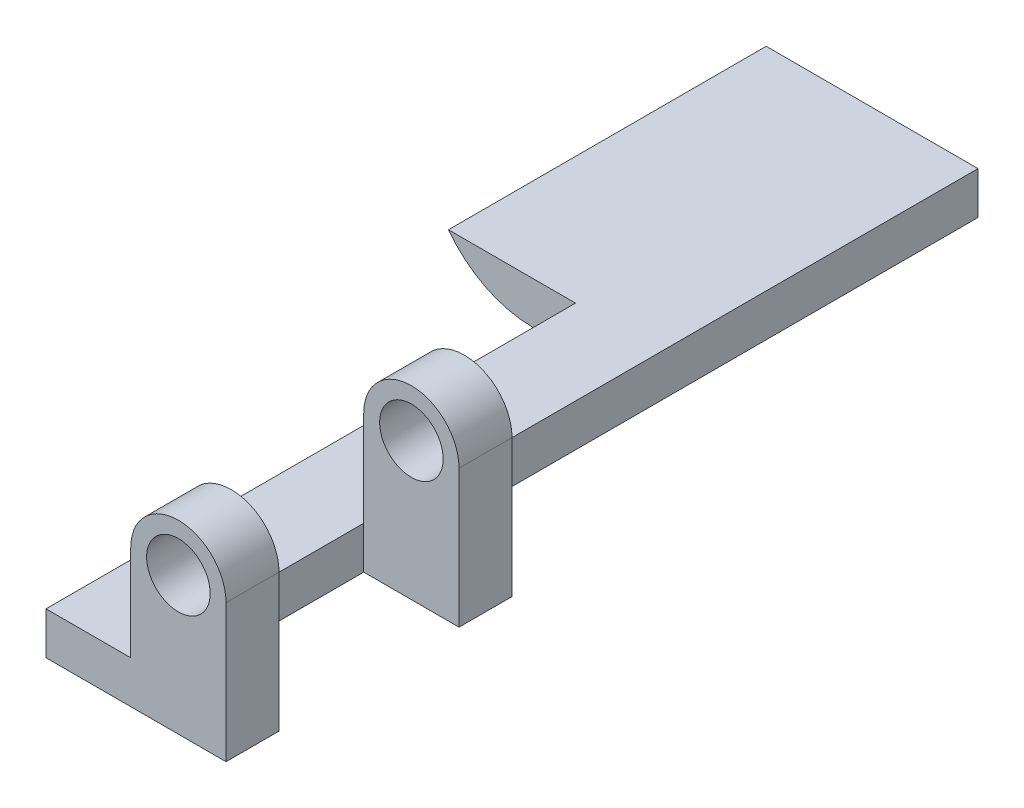
ISO-10303-21;
HEADER;
FILE_DESCRIPTION(('STEP AP214'),'2;1');
FILE_NAME('part.step','',(''),(''),'','','');
FILE_SCHEMA(('AUTOMOTIVE_DESIGN { 1 0 10303 214 1 1 1 1 }'));
ENDSEC;
DATA;
#1=APPLICATION_CONTEXT('core data for automotive mechanical design processes');
#2=APPLICATION_PROTOCOL_DEFINITION('international standard','automotive_design',2000,#1);
#3=PRODUCT_CONTEXT('',#1,'mechanical');
#4=PRODUCT('Part','Part','',(#3));
#5=PRODUCT_RELATED_PRODUCT_CATEGORY('part','',(#4));
#6=PRODUCT_DEFINITION_FORMATION('','',#4);
#7=PRODUCT_DEFINITION_CONTEXT('part definition',#1,'design');
#8=PRODUCT_DEFINITION('design','',#6,#7);
#9=PRODUCT_DEFINITION_SHAPE('','',#8);
#10=(LENGTH_UNIT() NAMED_UNIT(*) SI_UNIT(.MILLI.,.METRE.));
#11=(NAMED_UNIT(*) PLANE_ANGLE_UNIT() SI_UNIT($,.RADIAN.));
#12=(NAMED_UNIT(*) SI_UNIT($,.STERADIAN.) SOLID_ANGLE_UNIT());
#13=UNCERTAINTY_MEASURE_WITH_UNIT(LENGTH_MEASURE(1.E-05),#10,'distance_accuracy_value','');
#14=(GEOMETRIC_REPRESENTATION_CONTEXT(3) GLOBAL_UNCERTAINTY_ASSIGNED_CONTEXT((#13)) GLOBAL_UNIT_ASSIGNED_CONTEXT((#10,
#11,#12)) REPRESENTATION_CONTEXT('',''));
#15=CARTESIAN_POINT('',(0.,0.,0.));
#16=DIRECTION('',(0.,0.,1.));
#17=DIRECTION('',(1.,0.,0.));
#18=AXIS2_PLACEMENT_3D('',#15,#16,#17);
#19=CARTESIAN_POINT('',(50.6295676154831,0.,37.));
#20=DIRECTION('',(-1.,0.,0.));
#21=DIRECTION('',(0.,0.,1.));
#22=AXIS2_PLACEMENT_3D('',#19,#20,#21);
#23=PLANE('',#22);
#24=DIRECTION('',(0.,0.,-1.));
#25=VECTOR('',#24,1.);
#26=CARTESIAN_POINT('',(50.6295676154831,19.9021158128185,37.));
#27=LINE('',#26,#25);
#28=CARTESIAN_POINT('',(50.6295676154831,19.9021158128185,37.));
#29=VERTEX_POINT('',#28);
#30=CARTESIAN_POINT('',(50.6295676154831,19.9021158128185,32.));
#31=VERTEX_POINT('',#30);
#32=EDGE_CURVE('E166',#29,#31,#27,.T.);
#33=ORIENTED_EDGE('',*,*,#32,.T.);
#34=DIRECTION('',(0.,-1.,0.));
#35=VECTOR('',#34,1.);
#36=CARTESIAN_POINT('',(50.6295676154831,38.9021158128185,32.));
#37=LINE('',#36,#35);
#38=CARTESIAN_POINT('',(50.6295676154831,32.9021158128185,32.));
#39=VERTEX_POINT('',#38);
#40=EDGE_CURVE('E312',#39,#31,#37,.T.);
#41=ORIENTED_EDGE('',*,*,#40,.F.);
#42=DIRECTION('',(0.,0.,-1.));
#43=VECTOR('',#42,1.);
#44=CARTESIAN_POINT('',(50.6295676154831,32.9021158128185,37.));
#45=LINE('',#44,#43);
#46=CARTESIAN_POINT('',(50.6295676154831,32.9021158128185,37.));
#47=VERTEX_POINT('',#46);
#48=EDGE_CURVE('E167',#47,#39,#45,.T.);
#49=ORIENTED_EDGE('',*,*,#48,.F.);
#50=DIRECTION('',(0.,1.,0.));
#51=VECTOR('',#50,1.);
#52=CARTESIAN_POINT('',(50.6295676154831,0.,37.));
#53=LINE('',#52,#51);
#54=EDGE_CURVE('E225',#29,#47,#53,.T.);
#55=ORIENTED_EDGE('',*,*,#54,.F.);
#56=EDGE_LOOP('',(#33,#41,#49,#55));
#57=FACE_BOUND('',#56,.T.);
#58=ADVANCED_FACE('F35',(#57),#23,.F.);
#59=CARTESIAN_POINT('',(46.1295676154831,32.9021158128185,37.));
#60=DIRECTION('',(0.,0.,-1.));
#61=DIRECTION('',(-1.,0.,0.));
#62=AXIS2_PLACEMENT_3D('',#59,#60,#61);
#63=CYLINDRICAL_SURFACE('',#62,4.5);
#64=CARTESIAN_POINT('',(46.1295676154831,32.9021158128185,32.));
#65=DIRECTION('',(0.,0.,1.));
#66=DIRECTION('',(1.,0.,0.));
#67=AXIS2_PLACEMENT_3D('',#64,#65,#66);
#68=CIRCLE('',#67,4.5);
#69=CARTESIAN_POINT('',(41.6295676154831,32.9021158128185,32.));
#70=VERTEX_POINT('',#69);
#71=EDGE_CURVE('E186',#70,#39,#68,.F.);
#72=ORIENTED_EDGE('',*,*,#71,.F.);
#73=DIRECTION('',(0.,0.,-1.));
#74=VECTOR('',#73,1.);
#75=CARTESIAN_POINT('',(41.6295676154831,32.9021158128185,37.));
#76=LINE('',#75,#74);
#77=CARTESIAN_POINT('',(41.6295676154831,32.9021158128185,37.));
#78=VERTEX_POINT('',#77);
#79=EDGE_CURVE('E246',#78,#70,#76,.T.);
#80=ORIENTED_EDGE('',*,*,#79,.F.);
#81=CARTESIAN_POINT('',(46.1295676154831,32.9021158128185,37.));
#82=DIRECTION('',(0.,0.,1.));
#83=DIRECTION('',(1.,0.,0.));
#84=AXIS2_PLACEMENT_3D('',#81,#82,#83);
#85=CIRCLE('',#84,4.5);
#86=EDGE_CURVE('E227',#78,#47,#85,.F.);
#87=ORIENTED_EDGE('',*,*,#86,.T.);
#88=ORIENTED_EDGE('',*,*,#48,.T.);
#89=EDGE_LOOP('',(#72,#80,#87,#88));
#90=FACE_BOUND('',#89,.T.);
#91=ADVANCED_FACE('F261',(#90),#63,.T.);
#92=CARTESIAN_POINT('',(41.6295676154831,0.,37.));
#93=DIRECTION('',(-1.,0.,0.));
#94=DIRECTION('',(0.,-1.,0.));
#95=AXIS2_PLACEMENT_3D('',#92,#93,#94);
#96=PLANE('',#95);
#97=DIRECTION('',(0.,-1.,0.));
#98=VECTOR('',#97,1.);
#99=CARTESIAN_POINT('',(41.6295676154831,38.9021158128185,32.));
#100=LINE('',#99,#98);
#101=CARTESIAN_POINT('',(41.6295676154831,23.9021158128185,32.));
#102=VERTEX_POINT('',#101);
#103=EDGE_CURVE('E161',#70,#102,#100,.T.);
#104=ORIENTED_EDGE('',*,*,#103,.T.);
#105=DIRECTION('',(0.,0.,-1.));
#106=VECTOR('',#105,1.);
#107=CARTESIAN_POINT('',(41.6295676154831,23.9021158128185,37.));
#108=LINE('',#107,#106);
#109=CARTESIAN_POINT('',(41.6295676154831,23.9021158128185,37.));
#110=VERTEX_POINT('',#109);
#111=EDGE_CURVE('E242',#110,#102,#108,.T.);
#112=ORIENTED_EDGE('',*,*,#111,.F.);
#113=DIRECTION('',(0.,1.,0.));
#114=VECTOR('',#113,1.);
#115=CARTESIAN_POINT('',(41.6295676154831,0.,37.));
#116=LINE('',#115,#114);
#117=EDGE_CURVE('E230',#110,#78,#116,.T.);
#118=ORIENTED_EDGE('',*,*,#117,.T.);
#119=ORIENTED_EDGE('',*,*,#79,.T.);
#120=EDGE_LOOP('',(#104,#112,#118,#119));
#121=FACE_BOUND('',#120,.T.);
#122=ADVANCED_FACE('F268',(#121),#96,.T.);
#123=CARTESIAN_POINT('',(46.1295676154831,32.9021158128185,37.));
#124=DIRECTION('',(0.,0.,-1.));
#125=DIRECTION('',(-1.,0.,0.));
#126=AXIS2_PLACEMENT_3D('',#123,#124,#125);
#127=CYLINDRICAL_SURFACE('',#126,3.);
#128=CARTESIAN_POINT('',(46.1295676154831,32.9021158128185,32.));
#129=DIRECTION('',(0.,0.,1.));
#130=DIRECTION('',(1.,0.,0.));
#131=AXIS2_PLACEMENT_3D('',#128,#129,#130);
#132=CIRCLE('',#131,3.);
#133=CARTESIAN_POINT('',(49.1295676154831,32.9021158128185,32.));
#134=VERTEX_POINT('',#133);
#135=EDGE_CURVE('E184',#134,#134,#132,.T.);
#136=ORIENTED_EDGE('',*,*,#135,.F.);
#137=EDGE_LOOP('',(#136));
#138=FACE_BOUND('',#137,.T.);
#139=CARTESIAN_POINT('',(46.1295676154831,32.9021158128185,37.));
#140=DIRECTION('',(0.,0.,1.));
#141=DIRECTION('',(1.,0.,0.));
#142=AXIS2_PLACEMENT_3D('',#139,#140,#141);
#143=CIRCLE('',#142,3.);
#144=CARTESIAN_POINT('',(49.1295676154831,32.9021158128185,37.));
#145=VERTEX_POINT('',#144);
#146=EDGE_CURVE('E236',#145,#145,#143,.T.);
#147=ORIENTED_EDGE('',*,*,#146,.T.);
#148=EDGE_LOOP('',(#147));
#149=FACE_BOUND('',#148,.T.);
#150=ADVANCED_FACE('F280',(#138,#149),#127,.F.);
#151=CARTESIAN_POINT('',(33.6295676154831,0.,37.));
#152=DIRECTION('',(-1.,0.,0.));
#153=DIRECTION('',(0.,0.,1.));
#154=AXIS2_PLACEMENT_3D('',#151,#152,#153);
#155=PLANE('',#154);
#156=DIRECTION('',(0.,0.,-1.));
#157=VECTOR('',#156,1.);
#158=CARTESIAN_POINT('',(33.6295676154831,23.9021158128185,37.));
#159=LINE('',#158,#157);
#160=CARTESIAN_POINT('',(33.6295676154831,23.9021158128185,37.));
#161=VERTEX_POINT('',#160);
#162=CARTESIAN_POINT('',(33.6295676154831,23.9021158128185,-13.));
#163=VERTEX_POINT('',#162);
#164=EDGE_CURVE('E239',#161,#163,#159,.T.);
#165=ORIENTED_EDGE('',*,*,#164,.T.);
#166=DIRECTION('',(0.,1.,0.));
#167=VECTOR('',#166,1.);
#168=CARTESIAN_POINT('',(33.6295676154831,19.9021158128185,-13.));
#169=LINE('',#168,#167);
#170=CARTESIAN_POINT('',(33.6295676154831,19.9021158128185,-13.));
#171=VERTEX_POINT('',#170);
#172=EDGE_CURVE('E213',#171,#163,#169,.T.);
#173=ORIENTED_EDGE('',*,*,#172,.F.);
#174=DIRECTION('',(0.,0.,-1.));
#175=VECTOR('',#174,1.);
#176=CARTESIAN_POINT('',(33.6295676154831,19.9021158128185,37.));
#177=LINE('',#176,#175);
#178=CARTESIAN_POINT('',(33.6295676154831,19.9021158128185,37.));
#179=VERTEX_POINT('',#178);
#180=EDGE_CURVE('E170',#179,#171,#177,.T.);
#181=ORIENTED_EDGE('',*,*,#180,.F.);
#182=DIRECTION('',(0.,1.,0.));
#183=VECTOR('',#182,1.);
#184=CARTESIAN_POINT('',(33.6295676154831,0.,37.));
#185=LINE('',#184,#183);
#186=EDGE_CURVE('E219',#179,#161,#185,.T.);
#187=ORIENTED_EDGE('',*,*,#186,.T.);
#188=EDGE_LOOP('',(#165,#173,#181,#187));
#189=FACE_BOUND('',#188,.T.);
#190=ADVANCED_FACE('F278',(#189),#155,.T.);
#191=CARTESIAN_POINT('',(0.,19.9021158128185,37.));
#192=DIRECTION('',(0.,-1.,0.));
#193=DIRECTION('',(0.,0.,-1.));
#194=AXIS2_PLACEMENT_3D('',#191,#192,#193);
#195=PLANE('',#194);
#196=DIRECTION('',(0.,0.,1.));
#197=VECTOR('',#196,1.);
#198=CARTESIAN_POINT('',(41.6295676154831,19.9021158128185,-13.));
#199=LINE('',#198,#197);
#200=CARTESIAN_POINT('',(41.6295676154831,19.9021158128185,-43.));
#201=VERTEX_POINT('',#200);
#202=CARTESIAN_POINT('',(41.6295676154831,19.9021158128185,10.));
#203=VERTEX_POINT('',#202);
#204=EDGE_CURVE('E159',#201,#203,#199,.T.);
#205=ORIENTED_EDGE('',*,*,#204,.T.);
#206=DIRECTION('',(-1.,0.,0.));
#207=VECTOR('',#206,1.);
#208=CARTESIAN_POINT('',(41.6295676154831,19.9021158128185,10.));
#209=LINE('',#208,#207);
#210=CARTESIAN_POINT('',(50.6295676154831,19.9021158128185,10.));
#211=VERTEX_POINT('',#210);
#212=EDGE_CURVE('E146',#211,#203,#209,.T.);
#213=ORIENTED_EDGE('',*,*,#212,.F.);
#214=CARTESIAN_POINT('',(50.6295676154831,19.9021158128185,15.));
#215=VERTEX_POINT('',#214);
#216=EDGE_CURVE('E158',#215,#211,#27,.T.);
#217=ORIENTED_EDGE('',*,*,#216,.F.);
#218=DIRECTION('',(1.,0.,0.));
#219=VECTOR('',#218,1.);
#220=CARTESIAN_POINT('',(41.6295676154831,19.9021158128185,15.));
#221=LINE('',#220,#219);
#222=CARTESIAN_POINT('',(41.6295676154831,19.9021158128185,15.));
#223=VERTEX_POINT('',#222);
#224=EDGE_CURVE('E319',#223,#215,#221,.T.);
#225=ORIENTED_EDGE('',*,*,#224,.F.);
#226=DIRECTION('',(0.,0.,-1.));
#227=VECTOR('',#226,1.);
#228=CARTESIAN_POINT('',(41.6295676154831,19.9021158128185,15.));
#229=LINE('',#228,#227);
#230=CARTESIAN_POINT('',(41.6295676154831,19.9021158128185,32.));
#231=VERTEX_POINT('',#230);
#232=EDGE_CURVE('E322',#231,#223,#229,.T.);
#233=ORIENTED_EDGE('',*,*,#232,.F.);
#234=DIRECTION('',(-1.,0.,0.));
#235=VECTOR('',#234,1.);
#236=CARTESIAN_POINT('',(41.6295676154831,19.9021158128185,32.));
#237=LINE('',#236,#235);
#238=EDGE_CURVE('E315',#31,#231,#237,.T.);
#239=ORIENTED_EDGE('',*,*,#238,.F.);
#240=ORIENTED_EDGE('',*,*,#32,.F.);
#241=DIRECTION('',(-1.,0.,0.));
#242=VECTOR('',#241,1.);
#243=CARTESIAN_POINT('',(0.,19.9021158128185,37.));
#244=LINE('',#243,#242);
#245=EDGE_CURVE('E222',#29,#179,#244,.T.);
#246=ORIENTED_EDGE('',*,*,#245,.T.);
#247=ORIENTED_EDGE('',*,*,#180,.T.);
#248=DIRECTION('',(-1.,0.,0.));
#249=VECTOR('',#248,1.);
#250=CARTESIAN_POINT('',(41.6295676154831,19.9021158128185,-13.));
#251=LINE('',#250,#249);
#252=CARTESIAN_POINT('',(29.6295676154831,19.9021158128185,-13.));
#253=VERTEX_POINT('',#252);
#254=EDGE_CURVE('E197',#171,#253,#251,.T.);
#255=ORIENTED_EDGE('',*,*,#254,.T.);
#256=DIRECTION('',(0.,0.,-1.));
#257=VECTOR('',#256,1.);
#258=CARTESIAN_POINT('',(29.6295676154831,19.9021158128185,-43.));
#259=LINE('',#258,#257);
#260=CARTESIAN_POINT('',(29.6295676154831,19.9021158128185,-43.));
#261=VERTEX_POINT('',#260);
#262=EDGE_CURVE('E44',#253,#261,#259,.T.);
#263=ORIENTED_EDGE('',*,*,#262,.T.);
#264=DIRECTION('',(-1.,0.,0.));
#265=VECTOR('',#264,1.);
#266=CARTESIAN_POINT('',(41.6295676154831,19.9021158128185,-43.));
#267=LINE('',#266,#265);
#268=EDGE_CURVE('E198',#201,#261,#267,.T.);
#269=ORIENTED_EDGE('',*,*,#268,.F.);
#270=EDGE_LOOP('',(#205,#213,#217,#225,#233,#239,#240,#246,#247,#255,#263,#269));
#271=FACE_BOUND('',#270,.T.);
#272=ADVANCED_FACE('F156',(#271),#195,.T.);
#273=ORIENTED_EDGE('',*,*,#216,.T.);
#274=DIRECTION('',(0.,-1.,0.));
#275=VECTOR('',#274,1.);
#276=CARTESIAN_POINT('',(50.6295676154831,38.9021158128185,10.));
#277=LINE('',#276,#275);
#278=CARTESIAN_POINT('',(50.6295676154831,32.9021158128185,10.));
#279=VERTEX_POINT('',#278);
#280=EDGE_CURVE('E141',#279,#211,#277,.T.);
#281=ORIENTED_EDGE('',*,*,#280,.F.);
#282=CARTESIAN_POINT('',(50.6295676154831,32.9021158128185,15.));
#283=VERTEX_POINT('',#282);
#284=EDGE_CURVE('E172',#283,#279,#45,.T.);
#285=ORIENTED_EDGE('',*,*,#284,.F.);
#286=DIRECTION('',(0.,-1.,0.));
#287=VECTOR('',#286,1.);
#288=CARTESIAN_POINT('',(50.6295676154831,38.9021158128185,15.));
#289=LINE('',#288,#287);
#290=EDGE_CURVE('E165',#283,#215,#289,.T.);
#291=ORIENTED_EDGE('',*,*,#290,.T.);
#292=EDGE_LOOP('',(#273,#281,#285,#291));
#293=FACE_BOUND('',#292,.T.);
#294=ADVANCED_FACE('F164',(#293),#23,.F.);
#295=CARTESIAN_POINT('',(46.1295676154831,32.9021158128185,10.));
#296=DIRECTION('',(0.,0.,1.));
#297=DIRECTION('',(1.,0.,0.));
#298=AXIS2_PLACEMENT_3D('',#295,#296,#297);
#299=CIRCLE('',#298,4.5);
#300=CARTESIAN_POINT('',(41.6295676154831,32.9021158128185,10.));
#301=VERTEX_POINT('',#300);
#302=EDGE_CURVE('E148',#301,#279,#299,.F.);
#303=ORIENTED_EDGE('',*,*,#302,.F.);
#304=CARTESIAN_POINT('',(41.6295676154831,32.9021158128185,15.));
#305=VERTEX_POINT('',#304);
#306=EDGE_CURVE('E244',#305,#301,#76,.T.);
#307=ORIENTED_EDGE('',*,*,#306,.F.);
#308=CARTESIAN_POINT('',(46.1295676154831,32.9021158128185,15.));
#309=DIRECTION('',(0.,0.,-1.));
#310=DIRECTION('',(-1.,0.,0.));
#311=AXIS2_PLACEMENT_3D('',#308,#309,#310);
#312=CIRCLE('',#311,4.5);
#313=EDGE_CURVE('E182',#283,#305,#312,.F.);
#314=ORIENTED_EDGE('',*,*,#313,.F.);
#315=ORIENTED_EDGE('',*,*,#284,.T.);
#316=EDGE_LOOP('',(#303,#307,#314,#315));
#317=FACE_BOUND('',#316,.T.);
#318=ADVANCED_FACE('F258',(#317),#63,.T.);
#319=DIRECTION('',(0.,-1.,0.));
#320=VECTOR('',#319,1.);
#321=CARTESIAN_POINT('',(41.6295676154831,38.9021158128185,10.));
#322=LINE('',#321,#320);
#323=CARTESIAN_POINT('',(41.6295676154831,23.9021158128185,10.));
#324=VERTEX_POINT('',#323);
#325=EDGE_CURVE('E183',#301,#324,#322,.T.);
#326=ORIENTED_EDGE('',*,*,#325,.T.);
#327=CARTESIAN_POINT('',(41.6295676154831,23.9021158128185,15.));
#328=VERTEX_POINT('',#327);
#329=EDGE_CURVE('E241',#328,#324,#108,.T.);
#330=ORIENTED_EDGE('',*,*,#329,.F.);
#331=DIRECTION('',(0.,-1.,0.));
#332=VECTOR('',#331,1.);
#333=CARTESIAN_POINT('',(41.6295676154831,38.9021158128185,15.));
#334=LINE('',#333,#332);
#335=EDGE_CURVE('E52',#305,#328,#334,.T.);
#336=ORIENTED_EDGE('',*,*,#335,.F.);
#337=ORIENTED_EDGE('',*,*,#306,.T.);
#338=EDGE_LOOP('',(#326,#330,#336,#337));
#339=FACE_BOUND('',#338,.T.);
#340=ADVANCED_FACE('F254',(#339),#96,.T.);
#341=CARTESIAN_POINT('',(0.,23.9021158128185,37.));
#342=DIRECTION('',(0.,1.,0.));
#343=DIRECTION('',(-1.,0.,0.));
#344=AXIS2_PLACEMENT_3D('',#341,#342,#343);
#345=PLANE('',#344);
#346=ORIENTED_EDGE('',*,*,#111,.T.);
#347=EDGE_CURVE('E245',#102,#328,#108,.T.);
#348=ORIENTED_EDGE('',*,*,#347,.T.);
#349=ORIENTED_EDGE('',*,*,#329,.T.);
#350=DIRECTION('',(0.,0.,1.));
#351=VECTOR('',#350,1.);
#352=CARTESIAN_POINT('',(41.6295676154831,23.9021158128185,-13.));
#353=LINE('',#352,#351);
#354=CARTESIAN_POINT('',(41.6295676154831,23.9021158128185,-43.));
#355=VERTEX_POINT('',#354);
#356=EDGE_CURVE('E217',#355,#324,#353,.T.);
#357=ORIENTED_EDGE('',*,*,#356,.F.);
#358=DIRECTION('',(1.,0.,0.));
#359=VECTOR('',#358,1.);
#360=CARTESIAN_POINT('',(41.6295676154831,23.9021158128185,-43.));
#361=LINE('',#360,#359);
#362=CARTESIAN_POINT('',(21.6295676154831,23.9021158128185,-43.));
#363=VERTEX_POINT('',#362);
#364=EDGE_CURVE('E200',#363,#355,#361,.T.);
#365=ORIENTED_EDGE('',*,*,#364,.F.);
#366=DIRECTION('',(0.,0.,1.));
#367=VECTOR('',#366,1.);
#368=CARTESIAN_POINT('',(21.6295676154831,23.9021158128185,-43.));
#369=LINE('',#368,#367);
#370=CARTESIAN_POINT('',(21.6295676154831,23.9021158128185,-13.));
#371=VERTEX_POINT('',#370);
#372=EDGE_CURVE('E207',#363,#371,#369,.T.);
#373=ORIENTED_EDGE('',*,*,#372,.T.);
#374=DIRECTION('',(1.,0.,0.));
#375=VECTOR('',#374,1.);
#376=CARTESIAN_POINT('',(41.6295676154831,23.9021158128185,-13.));
#377=LINE('',#376,#375);
#378=EDGE_CURVE('E201',#371,#163,#377,.T.);
#379=ORIENTED_EDGE('',*,*,#378,.T.);
#380=ORIENTED_EDGE('',*,*,#164,.F.);
#381=DIRECTION('',(1.,0.,0.));
#382=VECTOR('',#381,1.);
#383=CARTESIAN_POINT('',(0.,23.9021158128185,37.));
#384=LINE('',#383,#382);
#385=EDGE_CURVE('E233',#161,#110,#384,.T.);
#386=ORIENTED_EDGE('',*,*,#385,.T.);
#387=EDGE_LOOP('',(#346,#348,#349,#357,#365,#373,#379,#380,#386));
#388=FACE_BOUND('',#387,.T.);
#389=ADVANCED_FACE('F266',(#388),#345,.T.);
#390=CARTESIAN_POINT('',(0.,0.,37.));
#391=DIRECTION('',(0.,0.,1.));
#392=DIRECTION('',(1.,0.,0.));
#393=AXIS2_PLACEMENT_3D('',#390,#391,#392);
#394=PLANE('',#393);
#395=ORIENTED_EDGE('',*,*,#186,.F.);
#396=ORIENTED_EDGE('',*,*,#245,.F.);
#397=ORIENTED_EDGE('',*,*,#54,.T.);
#398=ORIENTED_EDGE('',*,*,#86,.F.);
#399=ORIENTED_EDGE('',*,*,#117,.F.);
#400=ORIENTED_EDGE('',*,*,#385,.F.);
#401=EDGE_LOOP('',(#395,#396,#397,#398,#399,#400));
#402=FACE_BOUND('',#401,.T.);
#403=ORIENTED_EDGE('',*,*,#146,.F.);
#404=EDGE_LOOP('',(#403));
#405=FACE_BOUND('',#404,.T.);
#406=ADVANCED_FACE('F302',(#402,#405),#394,.T.);
#407=CARTESIAN_POINT('',(41.6295676154831,19.9021158128185,-13.));
#408=DIRECTION('',(-1.,0.,0.));
#409=DIRECTION('',(0.,0.,1.));
#410=AXIS2_PLACEMENT_3D('',#407,#408,#409);
#411=PLANE('',#410);
#412=ORIENTED_EDGE('',*,*,#356,.T.);
#413=EDGE_CURVE('E153',#324,#203,#322,.T.);
#414=ORIENTED_EDGE('',*,*,#413,.T.);
#415=ORIENTED_EDGE('',*,*,#204,.F.);
#416=DIRECTION('',(0.,-1.,0.));
#417=VECTOR('',#416,1.);
#418=CARTESIAN_POINT('',(41.6295676154831,19.9021158128185,-43.));
#419=LINE('',#418,#417);
#420=EDGE_CURVE('E204',#355,#201,#419,.T.);
#421=ORIENTED_EDGE('',*,*,#420,.F.);
#422=EDGE_LOOP('',(#412,#414,#415,#421));
#423=FACE_BOUND('',#422,.T.);
#424=ADVANCED_FACE('F326',(#423),#411,.F.);
#425=CARTESIAN_POINT('',(0.,0.,-13.));
#426=DIRECTION('',(0.,0.,-1.));
#427=DIRECTION('',(-1.,0.,0.));
#428=AXIS2_PLACEMENT_3D('',#425,#426,#427);
#429=PLANE('',#428);
#430=ORIENTED_EDGE('',*,*,#378,.F.);
#431=CARTESIAN_POINT('',(29.6295676154831,29.9021158128185,-13.));
#432=DIRECTION('',(0.,0.,-1.));
#433=DIRECTION('',(-1.,0.,0.));
#434=AXIS2_PLACEMENT_3D('',#431,#432,#433);
#435=CIRCLE('',#434,10.);
#436=EDGE_CURVE('E177',#371,#253,#435,.F.);
#437=ORIENTED_EDGE('',*,*,#436,.T.);
#438=ORIENTED_EDGE('',*,*,#254,.F.);
#439=ORIENTED_EDGE('',*,*,#172,.T.);
#440=EDGE_LOOP('',(#430,#437,#438,#439));
#441=FACE_BOUND('',#440,.T.);
#442=ADVANCED_FACE('F295',(#441),#429,.F.);
#443=CARTESIAN_POINT('',(0.,0.,-43.));
#444=DIRECTION('',(0.,0.,-1.));
#445=DIRECTION('',(-1.,0.,0.));
#446=AXIS2_PLACEMENT_3D('',#443,#444,#445);
#447=PLANE('',#446);
#448=ORIENTED_EDGE('',*,*,#268,.T.);
#449=CARTESIAN_POINT('',(29.6295676154831,29.9021158128185,-43.));
#450=DIRECTION('',(0.,0.,-1.));
#451=DIRECTION('',(-1.,0.,0.));
#452=AXIS2_PLACEMENT_3D('',#449,#450,#451);
#453=CIRCLE('',#452,10.);
#454=EDGE_CURVE('E11',#261,#363,#453,.T.);
#455=ORIENTED_EDGE('',*,*,#454,.T.);
#456=ORIENTED_EDGE('',*,*,#364,.T.);
#457=ORIENTED_EDGE('',*,*,#420,.T.);
#458=EDGE_LOOP('',(#448,#455,#456,#457));
#459=FACE_BOUND('',#458,.T.);
#460=ADVANCED_FACE('F329',(#459),#447,.T.);
#461=CARTESIAN_POINT('',(29.6295676154831,29.9021158128185,-43.));
#462=DIRECTION('',(0.,0.,1.));
#463=DIRECTION('',(1.,0.,0.));
#464=AXIS2_PLACEMENT_3D('',#461,#462,#463);
#465=CYLINDRICAL_SURFACE('',#464,10.);
#466=ORIENTED_EDGE('',*,*,#454,.F.);
#467=ORIENTED_EDGE('',*,*,#262,.F.);
#468=ORIENTED_EDGE('',*,*,#436,.F.);
#469=ORIENTED_EDGE('',*,*,#372,.F.);
#470=EDGE_LOOP('',(#466,#467,#468,#469));
#471=FACE_BOUND('',#470,.T.);
#472=ADVANCED_FACE('F37',(#471),#465,.T.);
#473=CARTESIAN_POINT('',(41.6295676154831,38.9021158128185,10.));
#474=DIRECTION('',(0.,0.,1.));
#475=DIRECTION('',(1.,0.,0.));
#476=AXIS2_PLACEMENT_3D('',#473,#474,#475);
#477=PLANE('',#476);
#478=ORIENTED_EDGE('',*,*,#302,.T.);
#479=ORIENTED_EDGE('',*,*,#280,.T.);
#480=ORIENTED_EDGE('',*,*,#212,.T.);
#481=ORIENTED_EDGE('',*,*,#413,.F.);
#482=ORIENTED_EDGE('',*,*,#325,.F.);
#483=EDGE_LOOP('',(#478,#479,#480,#481,#482));
#484=FACE_BOUND('',#483,.T.);
#485=CARTESIAN_POINT('',(46.1295676154831,32.9021158128185,10.));
#486=DIRECTION('',(0.,0.,1.));
#487=DIRECTION('',(1.,0.,0.));
#488=AXIS2_PLACEMENT_3D('',#485,#486,#487);
#489=CIRCLE('',#488,3.);
#490=CARTESIAN_POINT('',(49.1295676154831,32.9021158128185,10.));
#491=VERTEX_POINT('',#490);
#492=EDGE_CURVE('E39',#491,#491,#489,.T.);
#493=ORIENTED_EDGE('',*,*,#492,.T.);
#494=EDGE_LOOP('',(#493));
#495=FACE_BOUND('',#494,.T.);
#496=ADVANCED_FACE('F143',(#484,#495),#477,.F.);
#497=ORIENTED_EDGE('',*,*,#492,.F.);
#498=EDGE_LOOP('',(#497));
#499=FACE_BOUND('',#498,.T.);
#500=CARTESIAN_POINT('',(46.1295676154831,32.9021158128185,15.));
#501=DIRECTION('',(0.,0.,-1.));
#502=DIRECTION('',(-1.,0.,0.));
#503=AXIS2_PLACEMENT_3D('',#500,#501,#502);
#504=CIRCLE('',#503,3.);
#505=CARTESIAN_POINT('',(43.1295676154831,32.9021158128185,15.));
#506=VERTEX_POINT('',#505);
#507=EDGE_CURVE('E180',#506,#506,#504,.T.);
#508=ORIENTED_EDGE('',*,*,#507,.F.);
#509=EDGE_LOOP('',(#508));
#510=FACE_BOUND('',#509,.T.);
#511=ADVANCED_FACE('F287',(#499,#510),#127,.F.);
#512=CARTESIAN_POINT('',(41.6295676154831,38.9021158128185,15.));
#513=DIRECTION('',(-1.,0.,0.));
#514=DIRECTION('',(0.,0.,1.));
#515=AXIS2_PLACEMENT_3D('',#512,#513,#514);
#516=PLANE('',#515);
#517=ORIENTED_EDGE('',*,*,#347,.F.);
#518=EDGE_CURVE('E310',#102,#231,#100,.T.);
#519=ORIENTED_EDGE('',*,*,#518,.T.);
#520=ORIENTED_EDGE('',*,*,#232,.T.);
#521=EDGE_CURVE('E193',#328,#223,#334,.T.);
#522=ORIENTED_EDGE('',*,*,#521,.F.);
#523=EDGE_LOOP('',(#517,#519,#520,#522));
#524=FACE_BOUND('',#523,.T.);
#525=ADVANCED_FACE('F338',(#524),#516,.F.);
#526=CARTESIAN_POINT('',(41.6295676154831,38.9021158128185,32.));
#527=DIRECTION('',(0.,0.,1.));
#528=DIRECTION('',(1.,0.,0.));
#529=AXIS2_PLACEMENT_3D('',#526,#527,#528);
#530=PLANE('',#529);
#531=ORIENTED_EDGE('',*,*,#71,.T.);
#532=ORIENTED_EDGE('',*,*,#40,.T.);
#533=ORIENTED_EDGE('',*,*,#238,.T.);
#534=ORIENTED_EDGE('',*,*,#518,.F.);
#535=ORIENTED_EDGE('',*,*,#103,.F.);
#536=EDGE_LOOP('',(#531,#532,#533,#534,#535));
#537=FACE_BOUND('',#536,.T.);
#538=ORIENTED_EDGE('',*,*,#135,.T.);
#539=EDGE_LOOP('',(#538));
#540=FACE_BOUND('',#539,.T.);
#541=ADVANCED_FACE('F471',(#537,#540),#530,.F.);
#542=CARTESIAN_POINT('',(41.6295676154831,38.9021158128185,15.));
#543=DIRECTION('',(0.,0.,-1.));
#544=DIRECTION('',(-1.,0.,0.));
#545=AXIS2_PLACEMENT_3D('',#542,#543,#544);
#546=PLANE('',#545);
#547=ORIENTED_EDGE('',*,*,#313,.T.);
#548=ORIENTED_EDGE('',*,*,#335,.T.);
#549=ORIENTED_EDGE('',*,*,#521,.T.);
#550=ORIENTED_EDGE('',*,*,#224,.T.);
#551=ORIENTED_EDGE('',*,*,#290,.F.);
#552=EDGE_LOOP('',(#547,#548,#549,#550,#551));
#553=FACE_BOUND('',#552,.T.);
#554=ORIENTED_EDGE('',*,*,#507,.T.);
#555=EDGE_LOOP('',(#554));
#556=FACE_BOUND('',#555,.T.);
#557=ADVANCED_FACE('F480',(#553,#556),#546,.F.);
#558=CLOSED_SHELL('',(#58,#91,#122,#150,#190,#272,#294,#318,#340,#389,#406,#424,#442,#460,#472,
#496,#511,#525,#541,#557));
#559=MANIFOLD_SOLID_BREP('B2',#558);
#560=ADVANCED_BREP_SHAPE_REPRESENTATION('',(#18,#559),#14);
#561=SHAPE_DEFINITION_REPRESENTATION(#9,#560);
ENDSEC;
END-ISO-10303-21;
